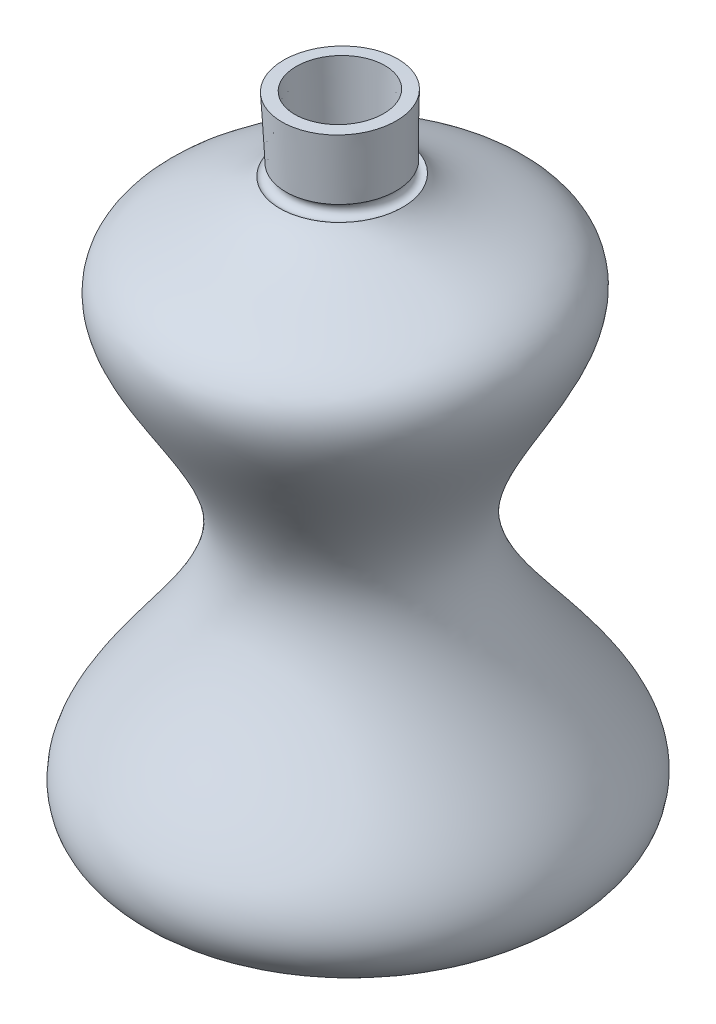
ISO-10303-21;
HEADER;
FILE_DESCRIPTION(('STEP AP214'),'2;1');
FILE_NAME('part.step','',(''),(''),'','','');
FILE_SCHEMA(('AUTOMOTIVE_DESIGN { 1 0 10303 214 1 1 1 1 }'));
ENDSEC;
DATA;
#1=APPLICATION_CONTEXT('core data for automotive mechanical design processes');
#2=APPLICATION_PROTOCOL_DEFINITION('international standard','automotive_design',2000,#1);
#3=PRODUCT_CONTEXT('',#1,'mechanical');
#4=PRODUCT('Part','Part','',(#3));
#5=PRODUCT_RELATED_PRODUCT_CATEGORY('part','',(#4));
#6=PRODUCT_DEFINITION_FORMATION('','',#4);
#7=PRODUCT_DEFINITION_CONTEXT('part definition',#1,'design');
#8=PRODUCT_DEFINITION('design','',#6,#7);
#9=PRODUCT_DEFINITION_SHAPE('','',#8);
#10=(LENGTH_UNIT() NAMED_UNIT(*) SI_UNIT(.MILLI.,.METRE.));
#11=(NAMED_UNIT(*) PLANE_ANGLE_UNIT() SI_UNIT($,.RADIAN.));
#12=(NAMED_UNIT(*) SI_UNIT($,.STERADIAN.) SOLID_ANGLE_UNIT());
#13=UNCERTAINTY_MEASURE_WITH_UNIT(LENGTH_MEASURE(1.E-05),#10,'distance_accuracy_value','');
#14=(GEOMETRIC_REPRESENTATION_CONTEXT(3) GLOBAL_UNCERTAINTY_ASSIGNED_CONTEXT((#13)) GLOBAL_UNIT_ASSIGNED_CONTEXT((#10,
#11,#12)) REPRESENTATION_CONTEXT('',''));
#15=CARTESIAN_POINT('',(0.,0.,0.));
#16=DIRECTION('',(0.,0.,1.));
#17=DIRECTION('',(1.,0.,0.));
#18=AXIS2_PLACEMENT_3D('',#15,#16,#17);
#19=CARTESIAN_POINT('',(37.1582968946507,3.48160065497549,0.));
#20=CARTESIAN_POINT('',(37.6785998914589,1.34594183171473,0.));
#21=CARTESIAN_POINT('',(39.6880101781633,-2.43763335036971,0.));
#22=CARTESIAN_POINT('',(45.9450821830452,-7.61396384884433,0.));
#23=CARTESIAN_POINT('',(54.8730245272454,-12.1218856317663,0.));
#24=CARTESIAN_POINT('',(65.0516330906407,-16.1328519229379,0.));
#25=CARTESIAN_POINT('',(73.5402144935533,-19.4545501171145,0.));
#26=CARTESIAN_POINT('',(79.7962487441327,-22.4369606596324,0.));
#27=CARTESIAN_POINT('',(84.1117007447407,-24.9734530322653,0.));
#28=CARTESIAN_POINT('',(87.9355426746375,-27.9745162136789,0.));
#29=CARTESIAN_POINT('',(91.0843225950964,-31.8306135202113,0.));
#30=CARTESIAN_POINT('',(92.9527193994278,-36.2844830119391,0.));
#31=CARTESIAN_POINT('',(93.6008319002438,-40.9237488491768,0.));
#32=CARTESIAN_POINT('',(93.2796476399978,-45.5595537946196,0.));
#33=CARTESIAN_POINT('',(91.8827863192698,-51.7225328553007,0.));
#34=CARTESIAN_POINT('',(88.7437244709194,-59.5204843030702,0.));
#35=CARTESIAN_POINT('',(83.6037280046596,-69.2591234491873,0.));
#36=CARTESIAN_POINT('',(77.7835647224968,-79.3580230557315,0.));
#37=CARTESIAN_POINT('',(71.9844087072325,-89.6829487696484,0.));
#38=CARTESIAN_POINT('',(66.9077026620661,-100.03450314067,0.));
#39=CARTESIAN_POINT('',(63.8545262646922,-108.459242768744,0.));
#40=CARTESIAN_POINT('',(62.4206406411007,-114.93194402196,0.));
#41=CARTESIAN_POINT('',(61.9102916242533,-119.589733893731,0.));
#42=CARTESIAN_POINT('',(62.0032883769561,-124.142286023218,0.));
#43=CARTESIAN_POINT('',(62.8616069045184,-130.212781118434,0.));
#44=CARTESIAN_POINT('',(65.2243280451119,-137.795697417196,0.));
#45=CARTESIAN_POINT('',(69.7924449007516,-146.878791534558,0.));
#46=CARTESIAN_POINT('',(77.6395255131526,-158.837811447105,0.));
#47=CARTESIAN_POINT('',(87.1840218110313,-170.399972857387,0.));
#48=CARTESIAN_POINT('',(96.4865870482093,-181.421449844111,0.));
#49=CARTESIAN_POINT('',(102.867553391603,-189.439185634015,0.));
#50=CARTESIAN_POINT('',(108.183130685146,-197.280082369439,0.));
#51=CARTESIAN_POINT('',(111.326709898569,-203.839367766711,0.));
#52=CARTESIAN_POINT('',(112.695418623288,-209.291324614318,0.));
#53=CARTESIAN_POINT('',(112.983463811487,-213.505092985212,0.));
#54=CARTESIAN_POINT('',(112.346965304903,-217.765658011103,0.));
#55=CARTESIAN_POINT('',(110.676636851096,-221.864717500661,0.));
#56=CARTESIAN_POINT('',(108.025378130304,-225.604112944088,0.));
#57=CARTESIAN_POINT('',(104.497199279401,-228.938002927822,0.));
#58=CARTESIAN_POINT('',(100.12561384104,-231.925220082715,0.));
#59=CARTESIAN_POINT('',(94.8737171539352,-234.638802438543,0.));
#60=CARTESIAN_POINT('',(88.6716625978522,-237.132578596427,0.));
#61=CARTESIAN_POINT('',(82.6460769728378,-239.055468043894,0.));
#62=CARTESIAN_POINT('',(77.2712482056834,-240.510452987745,0.));
#63=CARTESIAN_POINT('',(72.955453870183,-241.561118406841,0.));
#64=CARTESIAN_POINT('',(69.1070684262068,-242.405171668857,0.));
#65=CARTESIAN_POINT('',(65.8881020312702,-243.059032985331,0.));
#66=CARTESIAN_POINT('',(64.2048459342015,-243.383835105363,0.));
#67=CARTESIAN_POINT('',(63.3713305919519,-243.540683915392,0.));
#68=B_SPLINE_CURVE_WITH_KNOTS('',3,(#19,#20,#21,#22,#23,#24,#25,#26,#27,#28,#29,#30,#31,#32,#33,
#34,#35,#36,#37,#38,#39,#40,#41,#42,#43,#44,#45,#46,#47,#48,#49,#50,#51,#52,#53,#54,#55,#56,#57,
#58,#59,#60,#61,#62,#63,#64,#65,#66,#67),.UNSPECIFIED.,.F.,.F.,(4,1,1,1,1,1,1,1,1,1,1,1,1,1,1,1,
1,1,1,1,1,1,1,1,1,1,1,1,1,1,1,1,1,1,1,1,1,1,1,1,1,1,1,1,1,1,4),(0.0622866676212789,
0.091590209258114,0.120893750894949,0.150197292531784,0.179500834168619,0.208804375805454,
0.223456146623872,0.238107917442289,0.252759688260707,0.267411459079124,0.282063229897542,
0.296715000715959,0.311366771534377,0.326018542352794,0.355322083989629,0.384625625626464,
0.413929167263299,0.443232708900134,0.472536250536969,0.501839792173804,0.516491562992222,
0.531143333810639,0.545795104629057,0.560446875447475,0.58975041708431,0.619053958721145,
0.64835750035798,0.70696458363165,0.736268125268485,0.76557166690532,0.794875208542155,
0.82417875017899,0.838830520997407,0.853482291815825,0.868134062634242,0.88278583345266,
0.897437604271077,0.912089375089495,0.926741145907912,0.94139291672633,0.956044687544747,
0.970696458363165,0.978022343772374,0.985348229181582,0.992674114590791,0.996337057295396,1.),.UNSPECIFIED.);
#69=CARTESIAN_POINT('',(14.0941211289649,27.560449605716,0.));
#70=DIRECTION('',(-0.0310139992229796,0.999518950221654,0.));
#71=AXIS1_PLACEMENT('',#69,#70);
#72=SURFACE_OF_REVOLUTION('',#68,#71);
#73=CARTESIAN_POINT('',(22.545405018504,-244.807468525861,0.));
#74=DIRECTION('',(-0.0310139992229796,0.999518950221654,0.));
#75=DIRECTION('',(-0.999518950221654,-0.0310139992229796,0.));
#76=AXIS2_PLACEMENT_3D('',#73,#74,#75);
#77=CIRCLE('',#76,40.8455743279248);
#78=CARTESIAN_POINT('',(-18.280520554944,-246.074253136329,0.));
#79=VERTEX_POINT('',#78);
#80=EDGE_CURVE('E60',#79,#79,#77,.T.);
#81=ORIENTED_EDGE('',*,*,#80,.T.);
#82=EDGE_LOOP('',(#81));
#83=FACE_BOUND('',#82,.T.);
#84=CARTESIAN_POINT('',(15.0407255407887,-2.94671076334341,0.));
#85=DIRECTION('',(-0.0310139992229796,0.999518950221654,0.));
#86=DIRECTION('',(-0.999518950221654,-0.0310139992229796,0.));
#87=AXIS2_PLACEMENT_3D('',#84,#85,#86);
#88=CIRCLE('',#87,25.0443347851272);
#89=CARTESIAN_POINT('',(-9.99156167264134,-3.72343574290939,0.));
#90=VERTEX_POINT('',#89);
#91=EDGE_CURVE('E11',#90,#90,#88,.T.);
#92=ORIENTED_EDGE('',*,*,#91,.F.);
#93=EDGE_LOOP('',(#92));
#94=FACE_BOUND('',#93,.T.);
#95=ADVANCED_FACE('F35',(#83,#94),#72,.F.);
#96=CARTESIAN_POINT('',(14.9714921670207,-0.715458077376731,0.));
#97=DIRECTION('',(-0.0310139992229796,0.999518950221654,0.));
#98=DIRECTION('',(-0.999518950221654,-0.0310139992229796,0.));
#99=AXIS2_PLACEMENT_3D('',#96,#97,#98);
#100=TOROIDAL_SURFACE('',#99,23.5876053636402,2.66558481690281);
#101=ORIENTED_EDGE('',*,*,#91,.T.);
#102=EDGE_LOOP('',(#101));
#103=FACE_BOUND('',#102,.T.);
#104=CARTESIAN_POINT('',(14.895267615692,1.7411062301616,0.));
#105=DIRECTION('',(-0.0310139992229796,0.999518950221654,0.));
#106=DIRECTION('',(-0.999518950221654,-0.0310139992229796,0.));
#107=AXIS2_PLACEMENT_3D('',#104,#105,#106);
#108=CIRCLE('',#107,22.5557022495804);
#109=CARTESIAN_POINT('',(-7.6495842183208,1.04156369811935,0.));
#110=VERTEX_POINT('',#109);
#111=EDGE_CURVE('E43',#110,#110,#108,.T.);
#112=ORIENTED_EDGE('',*,*,#111,.F.);
#113=EDGE_LOOP('',(#112));
#114=FACE_BOUND('',#113,.T.);
#115=ADVANCED_FACE('F79',(#103,#114),#100,.F.);
#116=CARTESIAN_POINT('',(14.1165769011283,26.8367451373633,0.));
#117=DIRECTION('',(-0.0310139992229796,0.999518950221654,0.));
#118=DIRECTION('',(-0.999518950221654,-0.0310139992229796,0.));
#119=AXIS2_PLACEMENT_3D('',#116,#117,#118);
#120=CONICAL_SURFACE('',#119,23.3347677334225,0.0310189732725829);
#121=ORIENTED_EDGE('',*,*,#111,.T.);
#122=EDGE_LOOP('',(#121));
#123=FACE_BOUND('',#122,.T.);
#124=CARTESIAN_POINT('',(14.1165769011283,26.8367451373633,0.));
#125=DIRECTION('',(-0.0310139992229796,0.999518950221654,0.));
#126=DIRECTION('',(-0.999518950221654,-0.0310139992229796,0.));
#127=AXIS2_PLACEMENT_3D('',#124,#125,#126);
#128=CIRCLE('',#127,23.3347677334225);
#129=CARTESIAN_POINT('',(-9.20696564744835,26.1130406690105,0.));
#130=VERTEX_POINT('',#129);
#131=EDGE_CURVE('E71',#130,#130,#128,.T.);
#132=ORIENTED_EDGE('',*,*,#131,.F.);
#133=EDGE_LOOP('',(#132));
#134=FACE_BOUND('',#133,.T.);
#135=ADVANCED_FACE('F76',(#123,#134),#120,.T.);
#136=CARTESIAN_POINT('',(14.1115572258877,26.9985191959367,0.));
#137=DIRECTION('',(0.0310139992229796,-0.999518950221654,0.));
#138=DIRECTION('',(0.999518950221654,0.0310139992229796,0.));
#139=AXIS2_PLACEMENT_3D('',#136,#137,#138);
#140=CONICAL_SURFACE('',#139,18.1186052704527,1.53977735352231);
#141=ORIENTED_EDGE('',*,*,#131,.T.);
#142=EDGE_LOOP('',(#141));
#143=FACE_BOUND('',#142,.T.);
#144=CARTESIAN_POINT('',(14.1115572258877,26.9985191959367,0.));
#145=DIRECTION('',(-0.0310139992229796,0.999518950221654,0.));
#146=DIRECTION('',(-0.999518950221654,-0.0310139992229796,0.));
#147=AXIS2_PLACEMENT_3D('',#144,#145,#146);
#148=CIRCLE('',#147,18.1186052704527);
#149=CARTESIAN_POINT('',(-3.99833209351571,26.4365887861574,0.));
#150=VERTEX_POINT('',#149);
#151=EDGE_CURVE('E63',#150,#150,#148,.T.);
#152=ORIENTED_EDGE('',*,*,#151,.F.);
#153=EDGE_LOOP('',(#152));
#154=FACE_BOUND('',#153,.T.);
#155=ADVANCED_FACE('F86',(#143,#154),#140,.T.);
#156=CARTESIAN_POINT('',(14.895267615692,1.7411062301616,0.));
#157=DIRECTION('',(-0.0310139992229796,0.999518950221654,0.));
#158=DIRECTION('',(-0.999518950221654,-0.0310139992229796,0.));
#159=AXIS2_PLACEMENT_3D('',#156,#157,#158);
#160=CONICAL_SURFACE('',#159,17.3345176954942,0.0310189732725829);
#161=ORIENTED_EDGE('',*,*,#151,.T.);
#162=EDGE_LOOP('',(#161));
#163=FACE_BOUND('',#162,.T.);
#164=CARTESIAN_POINT('',(14.895267615692,1.7411062301616,0.));
#165=DIRECTION('',(-0.0310139992229796,0.999518950221654,0.));
#166=DIRECTION('',(-0.999518950221654,-0.0310139992229796,0.));
#167=AXIS2_PLACEMENT_3D('',#164,#165,#166);
#168=CIRCLE('',#167,17.3345176954942);
#169=CARTESIAN_POINT('',(-2.43091131390706,1.20349351182281,0.));
#170=VERTEX_POINT('',#169);
#171=EDGE_CURVE('E59',#170,#170,#168,.T.);
#172=ORIENTED_EDGE('',*,*,#171,.F.);
#173=EDGE_LOOP('',(#172));
#174=FACE_BOUND('',#173,.T.);
#175=ADVANCED_FACE('F92',(#163,#174),#160,.F.);
#176=CARTESIAN_POINT('',(32.2214465452911,2.27871894850038,0.));
#177=CARTESIAN_POINT('',(33.4599875499775,-2.80493981347248,0.));
#178=CARTESIAN_POINT('',(46.6013835218196,-18.7599328925635,0.));
#179=CARTESIAN_POINT('',(121.299400250552,-30.5197798540816,0.));
#180=CARTESIAN_POINT('',(-11.7412292535295,-150.323538334719,0.));
#181=CARTESIAN_POINT('',(168.920917169758,-218.508911318912,0.));
#182=CARTESIAN_POINT('',(62.4318524704643,-238.548311647698,0.));
#183=B_SPLINE_CURVE_WITH_KNOTS('',3,(#176,#177,#178,#179,#180,#181,#182),.UNSPECIFIED.,.F.,.F.,
(4,1,1,1,4),(0.0622866676212789,0.112058027422052,0.261563173195337,0.530321512269303,1.),.UNSPECIFIED.);
#184=CARTESIAN_POINT('',(14.0941211289649,27.560449605716,0.));
#185=DIRECTION('',(-0.0310139992229796,0.999518950221654,0.));
#186=AXIS1_PLACEMENT('',#184,#185);
#187=SURFACE_OF_REVOLUTION('',#183,#186);
#188=CARTESIAN_POINT('',(22.3897424173793,-239.790775304637,0.));
#189=DIRECTION('',(-0.0310139992229796,0.999518950221654,0.));
#190=DIRECTION('',(-0.999518950221654,-0.0310139992229796,0.));
#191=AXIS2_PLACEMENT_3D('',#188,#189,#190);
#192=CIRCLE('',#191,40.0613815718105);
#193=CARTESIAN_POINT('',(-17.6523676357058,-241.033238961577,0.));
#194=VERTEX_POINT('',#193);
#195=EDGE_CURVE('E57',#194,#194,#192,.T.);
#196=ORIENTED_EDGE('',*,*,#195,.F.);
#197=EDGE_LOOP('',(#196));
#198=FACE_BOUND('',#197,.T.);
#199=ORIENTED_EDGE('',*,*,#171,.T.);
#200=EDGE_LOOP('',(#199));
#201=FACE_BOUND('',#200,.T.);
#202=ADVANCED_FACE('F53',(#198,#201),#187,.T.);
#203=CARTESIAN_POINT('',(22.3897424173793,-239.790775304637,0.));
#204=DIRECTION('',(0.0310139992229796,-0.999518950221654,0.));
#205=DIRECTION('',(0.999518950221654,0.0310139992229796,0.));
#206=AXIS2_PLACEMENT_3D('',#203,#204,#205);
#207=CONICAL_SURFACE('',#206,40.0613815718104,1.42500371778678);
#208=CARTESIAN_POINT('',(22.2073059721778,-233.911214823613,0.));
#209=VERTEX_POINT('',#208);
#210=VERTEX_LOOP('',#209);
#211=FACE_BOUND('',#210,.T.);
#212=ORIENTED_EDGE('',*,*,#195,.T.);
#213=EDGE_LOOP('',(#212));
#214=FACE_BOUND('',#213,.T.);
#215=ADVANCED_FACE('F49',(#211,#214),#207,.T.);
#216=CARTESIAN_POINT('',(22.545405018504,-244.807468525861,0.));
#217=DIRECTION('',(0.0310139992229796,-0.999518950221654,0.));
#218=DIRECTION('',(0.999518950221654,0.0310139992229796,0.));
#219=AXIS2_PLACEMENT_3D('',#216,#217,#218);
#220=CONICAL_SURFACE('',#219,40.8455743279248,1.41866762647447);
#221=CARTESIAN_POINT('',(22.3511901580811,-238.548313361393,0.));
#222=VERTEX_POINT('',#221);
#223=VERTEX_LOOP('',#222);
#224=FACE_BOUND('',#223,.T.);
#225=ORIENTED_EDGE('',*,*,#80,.F.);
#226=EDGE_LOOP('',(#225));
#227=FACE_BOUND('',#226,.T.);
#228=ADVANCED_FACE('F52',(#224,#227),#220,.F.);
#229=CLOSED_SHELL('',(#95,#115,#135,#155,#175,#202,#215,#228));
#230=MANIFOLD_SOLID_BREP('B2',#229);
#231=ADVANCED_BREP_SHAPE_REPRESENTATION('',(#18,#230),#14);
#232=SHAPE_DEFINITION_REPRESENTATION(#9,#231);
ENDSEC;
END-ISO-10303-21;
